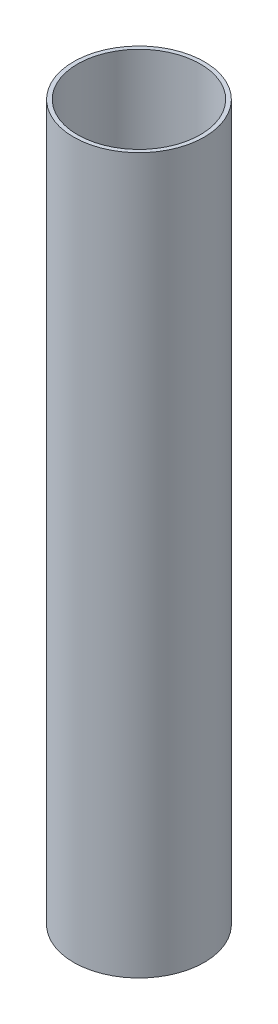
ISO-10303-21;
HEADER;
FILE_DESCRIPTION(('STEP AP214'),'2;1');
FILE_NAME('part.step','',(''),(''),'','','');
FILE_SCHEMA(('AUTOMOTIVE_DESIGN { 1 0 10303 214 1 1 1 1 }'));
ENDSEC;
DATA;
#1=APPLICATION_CONTEXT('core data for automotive mechanical design processes');
#2=APPLICATION_PROTOCOL_DEFINITION('international standard','automotive_design',2000,#1);
#3=PRODUCT_CONTEXT('',#1,'mechanical');
#4=PRODUCT('Part','Part','',(#3));
#5=PRODUCT_RELATED_PRODUCT_CATEGORY('part','',(#4));
#6=PRODUCT_DEFINITION_FORMATION('','',#4);
#7=PRODUCT_DEFINITION_CONTEXT('part definition',#1,'design');
#8=PRODUCT_DEFINITION('design','',#6,#7);
#9=PRODUCT_DEFINITION_SHAPE('','',#8);
#10=(LENGTH_UNIT() NAMED_UNIT(*) SI_UNIT(.MILLI.,.METRE.));
#11=(NAMED_UNIT(*) PLANE_ANGLE_UNIT() SI_UNIT($,.RADIAN.));
#12=(NAMED_UNIT(*) SI_UNIT($,.STERADIAN.) SOLID_ANGLE_UNIT());
#13=UNCERTAINTY_MEASURE_WITH_UNIT(LENGTH_MEASURE(1.E-05),#10,'distance_accuracy_value','');
#14=(GEOMETRIC_REPRESENTATION_CONTEXT(3) GLOBAL_UNCERTAINTY_ASSIGNED_CONTEXT((#13)) GLOBAL_UNIT_ASSIGNED_CONTEXT((#10,
#11,#12)) REPRESENTATION_CONTEXT('',''));
#15=CARTESIAN_POINT('',(0.,0.,0.));
#16=DIRECTION('',(0.,0.,1.));
#17=DIRECTION('',(1.,0.,0.));
#18=AXIS2_PLACEMENT_3D('',#15,#16,#17);
#19=CARTESIAN_POINT('',(0.,295.275,0.));
#20=DIRECTION('',(0.,1.,0.));
#21=DIRECTION('',(0.,0.,1.));
#22=AXIS2_PLACEMENT_3D('',#19,#20,#21);
#23=PLANE('',#22);
#24=CARTESIAN_POINT('',(0.,295.275,0.));
#25=DIRECTION('',(0.,1.,0.));
#26=DIRECTION('',(0.,0.,1.));
#27=AXIS2_PLACEMENT_3D('',#24,#25,#26);
#28=CIRCLE('',#27,27.);
#29=CARTESIAN_POINT('',(0.,295.275,27.));
#30=VERTEX_POINT('',#29);
#31=EDGE_CURVE('E10',#30,#30,#28,.T.);
#32=ORIENTED_EDGE('',*,*,#31,.T.);
#33=EDGE_LOOP('',(#32));
#34=FACE_BOUND('',#33,.T.);
#35=CARTESIAN_POINT('',(0.,295.275,0.));
#36=DIRECTION('',(0.,1.,0.));
#37=DIRECTION('',(0.,0.,1.));
#38=AXIS2_PLACEMENT_3D('',#35,#36,#37);
#39=CIRCLE('',#38,25.35);
#40=CARTESIAN_POINT('',(0.,295.275,25.35));
#41=VERTEX_POINT('',#40);
#42=EDGE_CURVE('E52',#41,#41,#39,.T.);
#43=ORIENTED_EDGE('',*,*,#42,.F.);
#44=EDGE_LOOP('',(#43));
#45=FACE_BOUND('',#44,.T.);
#46=ADVANCED_FACE('F39',(#34,#45),#23,.T.);
#47=CARTESIAN_POINT('',(0.,0.,0.));
#48=DIRECTION('',(0.,1.,0.));
#49=DIRECTION('',(0.,0.,1.));
#50=AXIS2_PLACEMENT_3D('',#47,#48,#49);
#51=PLANE('',#50);
#52=CARTESIAN_POINT('',(0.,0.,0.));
#53=DIRECTION('',(0.,1.,0.));
#54=DIRECTION('',(0.,0.,1.));
#55=AXIS2_PLACEMENT_3D('',#52,#53,#54);
#56=CIRCLE('',#55,27.);
#57=CARTESIAN_POINT('',(0.,0.,27.));
#58=VERTEX_POINT('',#57);
#59=EDGE_CURVE('E43',#58,#58,#56,.T.);
#60=ORIENTED_EDGE('',*,*,#59,.F.);
#61=EDGE_LOOP('',(#60));
#62=FACE_BOUND('',#61,.T.);
#63=CARTESIAN_POINT('',(0.,0.,0.));
#64=DIRECTION('',(0.,1.,0.));
#65=DIRECTION('',(0.,0.,1.));
#66=AXIS2_PLACEMENT_3D('',#63,#64,#65);
#67=CIRCLE('',#66,25.35);
#68=CARTESIAN_POINT('',(0.,0.,25.35));
#69=VERTEX_POINT('',#68);
#70=EDGE_CURVE('E54',#69,#69,#67,.T.);
#71=ORIENTED_EDGE('',*,*,#70,.T.);
#72=EDGE_LOOP('',(#71));
#73=FACE_BOUND('',#72,.T.);
#74=ADVANCED_FACE('F66',(#62,#73),#51,.F.);
#75=CARTESIAN_POINT('',(0.,295.275,0.));
#76=DIRECTION('',(0.,-1.,0.));
#77=DIRECTION('',(0.,0.,-1.));
#78=AXIS2_PLACEMENT_3D('',#75,#76,#77);
#79=CYLINDRICAL_SURFACE('',#78,27.);
#80=ORIENTED_EDGE('',*,*,#31,.F.);
#81=EDGE_LOOP('',(#80));
#82=FACE_BOUND('',#81,.T.);
#83=ORIENTED_EDGE('',*,*,#59,.T.);
#84=EDGE_LOOP('',(#83));
#85=FACE_BOUND('',#84,.T.);
#86=ADVANCED_FACE('F41',(#82,#85),#79,.T.);
#87=CARTESIAN_POINT('',(0.,295.275,0.));
#88=DIRECTION('',(0.,-1.,0.));
#89=DIRECTION('',(0.,0.,-1.));
#90=AXIS2_PLACEMENT_3D('',#87,#88,#89);
#91=CYLINDRICAL_SURFACE('',#90,25.35);
#92=ORIENTED_EDGE('',*,*,#42,.T.);
#93=EDGE_LOOP('',(#92));
#94=FACE_BOUND('',#93,.T.);
#95=ORIENTED_EDGE('',*,*,#70,.F.);
#96=EDGE_LOOP('',(#95));
#97=FACE_BOUND('',#96,.T.);
#98=ADVANCED_FACE('F62',(#94,#97),#91,.F.);
#99=CLOSED_SHELL('',(#46,#74,#86,#98));
#100=MANIFOLD_SOLID_BREP('B2',#99);
#101=ADVANCED_BREP_SHAPE_REPRESENTATION('',(#18,#100),#14);
#102=SHAPE_DEFINITION_REPRESENTATION(#9,#101);
ENDSEC;
END-ISO-10303-21;
